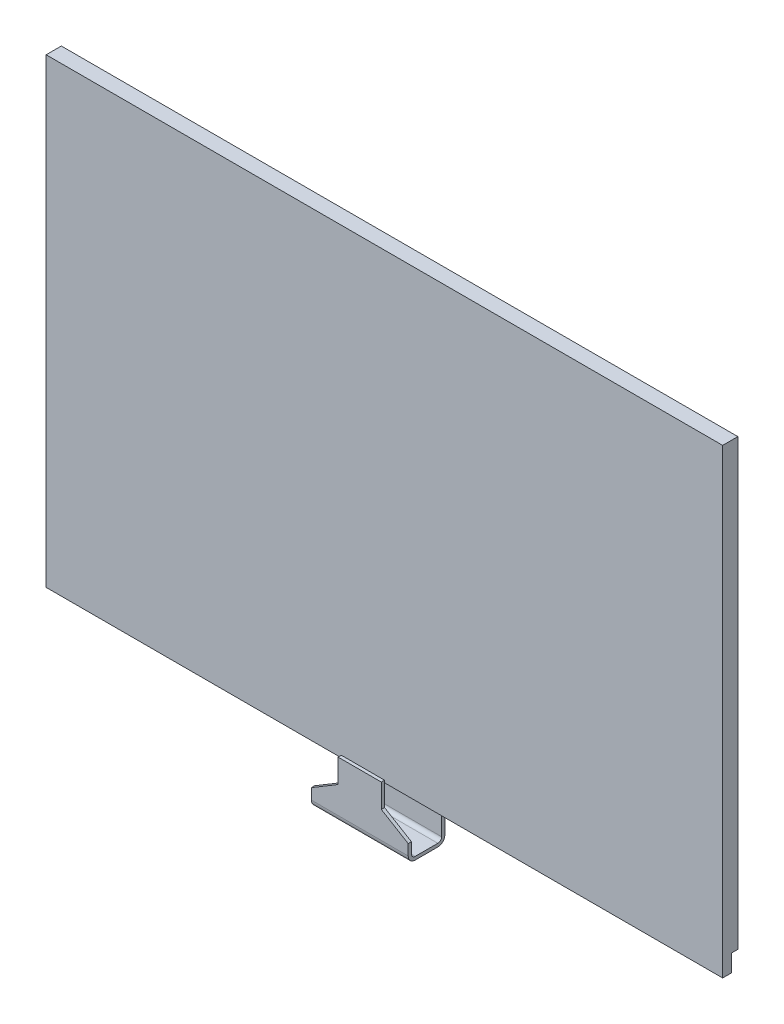
ISO-10303-21;
HEADER;
FILE_DESCRIPTION(('STEP AP214'),'2;1');
FILE_NAME('part.step','',(''),(''),'','','');
FILE_SCHEMA(('AUTOMOTIVE_DESIGN { 1 0 10303 214 1 1 1 1 }'));
ENDSEC;
DATA;
#1=APPLICATION_CONTEXT('core data for automotive mechanical design processes');
#2=APPLICATION_PROTOCOL_DEFINITION('international standard','automotive_design',2000,#1);
#3=PRODUCT_CONTEXT('',#1,'mechanical');
#4=PRODUCT('Part','Part','',(#3));
#5=PRODUCT_RELATED_PRODUCT_CATEGORY('part','',(#4));
#6=PRODUCT_DEFINITION_FORMATION('','',#4);
#7=PRODUCT_DEFINITION_CONTEXT('part definition',#1,'design');
#8=PRODUCT_DEFINITION('design','',#6,#7);
#9=PRODUCT_DEFINITION_SHAPE('','',#8);
#10=(LENGTH_UNIT() NAMED_UNIT(*) SI_UNIT(.MILLI.,.METRE.));
#11=(NAMED_UNIT(*) PLANE_ANGLE_UNIT() SI_UNIT($,.RADIAN.));
#12=(NAMED_UNIT(*) SI_UNIT($,.STERADIAN.) SOLID_ANGLE_UNIT());
#13=UNCERTAINTY_MEASURE_WITH_UNIT(LENGTH_MEASURE(1.E-05),#10,'distance_accuracy_value','');
#14=(GEOMETRIC_REPRESENTATION_CONTEXT(3) GLOBAL_UNCERTAINTY_ASSIGNED_CONTEXT((#13)) GLOBAL_UNIT_ASSIGNED_CONTEXT((#10,
#11,#12)) REPRESENTATION_CONTEXT('',''));
#15=CARTESIAN_POINT('',(0.,0.,0.));
#16=DIRECTION('',(0.,0.,1.));
#17=DIRECTION('',(1.,0.,0.));
#18=AXIS2_PLACEMENT_3D('',#15,#16,#17);
#19=CARTESIAN_POINT('',(31.4,21.41,0.));
#20=DIRECTION('',(0.,0.,1.));
#21=DIRECTION('',(1.,0.,0.));
#22=AXIS2_PLACEMENT_3D('',#19,#20,#21);
#23=PLANE('',#22);
#24=DIRECTION('',(1.,0.,0.));
#25=VECTOR('',#24,1.);
#26=CARTESIAN_POINT('',(31.4,1.6,0.));
#27=LINE('',#26,#25);
#28=CARTESIAN_POINT('',(0.,1.6,0.));
#29=VERTEX_POINT('',#28);
#30=CARTESIAN_POINT('',(62.8,1.6,0.));
#31=VERTEX_POINT('',#30);
#32=EDGE_CURVE('P0_E175',#29,#31,#27,.T.);
#33=ORIENTED_EDGE('',*,*,#32,.T.);
#34=DIRECTION('',(0.,-1.,0.));
#35=VECTOR('',#34,1.);
#36=CARTESIAN_POINT('',(62.8,42.82,0.));
#37=LINE('',#36,#35);
#38=CARTESIAN_POINT('',(62.8,0.,0.));
#39=VERTEX_POINT('',#38);
#40=EDGE_CURVE('P0_E196',#31,#39,#37,.T.);
#41=ORIENTED_EDGE('',*,*,#40,.T.);
#42=DIRECTION('',(-1.,0.,0.));
#43=VECTOR('',#42,1.);
#44=CARTESIAN_POINT('',(62.8,0.,0.));
#45=LINE('',#44,#43);
#46=CARTESIAN_POINT('',(0.,0.,0.));
#47=VERTEX_POINT('',#46);
#48=EDGE_CURVE('P0_E190',#39,#47,#45,.T.);
#49=ORIENTED_EDGE('',*,*,#48,.T.);
#50=DIRECTION('',(0.,1.,0.));
#51=VECTOR('',#50,1.);
#52=CARTESIAN_POINT('',(0.,0.,0.));
#53=LINE('',#52,#51);
#54=EDGE_CURVE('P0_E11',#47,#29,#53,.T.);
#55=ORIENTED_EDGE('',*,*,#54,.T.);
#56=EDGE_LOOP('',(#33,#41,#49,#55));
#57=FACE_BOUND('',#56,.T.);
#58=ADVANCED_FACE('P0_F17',(#57),#23,.F.);
#59=CARTESIAN_POINT('',(31.4,21.41,0.81));
#60=DIRECTION('',(0.,0.,1.));
#61=DIRECTION('',(1.,0.,0.));
#62=AXIS2_PLACEMENT_3D('',#59,#60,#61);
#63=PLANE('',#62);
#64=DIRECTION('',(1.,0.,0.));
#65=VECTOR('',#64,1.);
#66=CARTESIAN_POINT('',(0.,42.82,0.81));
#67=LINE('',#66,#65);
#68=CARTESIAN_POINT('',(0.,42.82,0.81));
#69=VERTEX_POINT('',#68);
#70=CARTESIAN_POINT('',(62.8,42.82,0.81));
#71=VERTEX_POINT('',#70);
#72=EDGE_CURVE('P0_E133',#69,#71,#67,.T.);
#73=ORIENTED_EDGE('',*,*,#72,.F.);
#74=DIRECTION('',(0.,1.,0.));
#75=VECTOR('',#74,1.);
#76=CARTESIAN_POINT('',(0.,0.,0.81));
#77=LINE('',#76,#75);
#78=CARTESIAN_POINT('',(0.,0.,0.81));
#79=VERTEX_POINT('',#78);
#80=EDGE_CURVE('P0_E27',#79,#69,#77,.T.);
#81=ORIENTED_EDGE('',*,*,#80,.F.);
#82=DIRECTION('',(-1.,0.,0.));
#83=VECTOR('',#82,1.);
#84=CARTESIAN_POINT('',(62.8,0.,0.81));
#85=LINE('',#84,#83);
#86=CARTESIAN_POINT('',(62.8,0.,0.81));
#87=VERTEX_POINT('',#86);
#88=EDGE_CURVE('P0_E200',#87,#79,#85,.T.);
#89=ORIENTED_EDGE('',*,*,#88,.F.);
#90=DIRECTION('',(0.,-1.,0.));
#91=VECTOR('',#90,1.);
#92=CARTESIAN_POINT('',(62.8,42.82,0.81));
#93=LINE('',#92,#91);
#94=EDGE_CURVE('P0_E172',#71,#87,#93,.T.);
#95=ORIENTED_EDGE('',*,*,#94,.F.);
#96=EDGE_LOOP('',(#73,#81,#89,#95));
#97=FACE_BOUND('',#96,.T.);
#98=ADVANCED_FACE('P0_F300',(#97),#63,.T.);
#99=CARTESIAN_POINT('',(0.,21.41,0.));
#100=DIRECTION('',(-1.,0.,0.));
#101=DIRECTION('',(0.,1.,0.));
#102=AXIS2_PLACEMENT_3D('',#99,#100,#101);
#103=PLANE('',#102);
#104=ORIENTED_EDGE('',*,*,#80,.T.);
#105=DIRECTION('',(0.,0.,1.));
#106=VECTOR('',#105,1.);
#107=CARTESIAN_POINT('',(0.,42.82,0.));
#108=LINE('',#107,#106);
#109=CARTESIAN_POINT('',(0.,42.82,-0.6));
#110=VERTEX_POINT('',#109);
#111=EDGE_CURVE('P0_E137',#110,#69,#108,.T.);
#112=ORIENTED_EDGE('',*,*,#111,.F.);
#113=DIRECTION('',(0.,-1.,0.));
#114=VECTOR('',#113,1.);
#115=CARTESIAN_POINT('',(0.,1.6,-0.6));
#116=LINE('',#115,#114);
#117=CARTESIAN_POINT('',(0.,1.6,-0.6));
#118=VERTEX_POINT('',#117);
#119=EDGE_CURVE('P0_E94',#110,#118,#116,.T.);
#120=ORIENTED_EDGE('',*,*,#119,.T.);
#121=DIRECTION('',(0.,0.,-1.));
#122=VECTOR('',#121,1.);
#123=CARTESIAN_POINT('',(0.,1.6,0.));
#124=LINE('',#123,#122);
#125=EDGE_CURVE('P0_E156',#29,#118,#124,.T.);
#126=ORIENTED_EDGE('',*,*,#125,.F.);
#127=ORIENTED_EDGE('',*,*,#54,.F.);
#128=DIRECTION('',(0.,0.,1.));
#129=VECTOR('',#128,1.);
#130=CARTESIAN_POINT('',(0.,0.,0.));
#131=LINE('',#130,#129);
#132=EDGE_CURVE('P0_E206',#47,#79,#131,.T.);
#133=ORIENTED_EDGE('',*,*,#132,.T.);
#134=EDGE_LOOP('',(#104,#112,#120,#126,#127,#133));
#135=FACE_BOUND('',#134,.T.);
#136=ADVANCED_FACE('P0_F277',(#135),#103,.T.);
#137=CARTESIAN_POINT('',(31.4,0.,0.));
#138=DIRECTION('',(0.,-1.,0.));
#139=DIRECTION('',(0.,0.,-1.));
#140=AXIS2_PLACEMENT_3D('',#137,#138,#139);
#141=PLANE('',#140);
#142=ORIENTED_EDGE('',*,*,#88,.T.);
#143=ORIENTED_EDGE('',*,*,#132,.F.);
#144=ORIENTED_EDGE('',*,*,#48,.F.);
#145=DIRECTION('',(0.,0.,1.));
#146=VECTOR('',#145,1.);
#147=CARTESIAN_POINT('',(62.8,0.,0.));
#148=LINE('',#147,#146);
#149=EDGE_CURVE('P0_E21',#39,#87,#148,.T.);
#150=ORIENTED_EDGE('',*,*,#149,.T.);
#151=EDGE_LOOP('',(#142,#143,#144,#150));
#152=FACE_BOUND('',#151,.T.);
#153=ADVANCED_FACE('P0_F272',(#152),#141,.T.);
#154=CARTESIAN_POINT('',(62.8,21.41,0.));
#155=DIRECTION('',(1.,0.,0.));
#156=DIRECTION('',(0.,1.,0.));
#157=AXIS2_PLACEMENT_3D('',#154,#155,#156);
#158=PLANE('',#157);
#159=ORIENTED_EDGE('',*,*,#94,.T.);
#160=ORIENTED_EDGE('',*,*,#149,.F.);
#161=ORIENTED_EDGE('',*,*,#40,.F.);
#162=DIRECTION('',(0.,0.,-1.));
#163=VECTOR('',#162,1.);
#164=CARTESIAN_POINT('',(62.8,1.6,0.));
#165=LINE('',#164,#163);
#166=CARTESIAN_POINT('',(62.8,1.6,-0.6));
#167=VERTEX_POINT('',#166);
#168=EDGE_CURVE('P0_E143',#31,#167,#165,.T.);
#169=ORIENTED_EDGE('',*,*,#168,.T.);
#170=DIRECTION('',(0.,1.,0.));
#171=VECTOR('',#170,1.);
#172=CARTESIAN_POINT('',(62.8,42.82,-0.6));
#173=LINE('',#172,#171);
#174=CARTESIAN_POINT('',(62.8,42.82,-0.6));
#175=VERTEX_POINT('',#174);
#176=EDGE_CURVE('P0_E140',#167,#175,#173,.T.);
#177=ORIENTED_EDGE('',*,*,#176,.T.);
#178=DIRECTION('',(0.,0.,1.));
#179=VECTOR('',#178,1.);
#180=CARTESIAN_POINT('',(62.8,42.82,0.));
#181=LINE('',#180,#179);
#182=EDGE_CURVE('P0_E127',#175,#71,#181,.T.);
#183=ORIENTED_EDGE('',*,*,#182,.T.);
#184=EDGE_LOOP('',(#159,#160,#161,#169,#177,#183));
#185=FACE_BOUND('',#184,.T.);
#186=ADVANCED_FACE('P0_F141',(#185),#158,.T.);
#187=CARTESIAN_POINT('',(31.4,42.82,0.));
#188=DIRECTION('',(0.,1.,0.));
#189=DIRECTION('',(1.,0.,0.));
#190=AXIS2_PLACEMENT_3D('',#187,#188,#189);
#191=PLANE('',#190);
#192=ORIENTED_EDGE('',*,*,#72,.T.);
#193=ORIENTED_EDGE('',*,*,#182,.F.);
#194=DIRECTION('',(-1.,0.,0.));
#195=VECTOR('',#194,1.);
#196=CARTESIAN_POINT('',(0.,42.82,-0.6));
#197=LINE('',#196,#195);
#198=EDGE_CURVE('P0_E132',#175,#110,#197,.T.);
#199=ORIENTED_EDGE('',*,*,#198,.T.);
#200=ORIENTED_EDGE('',*,*,#111,.T.);
#201=EDGE_LOOP('',(#192,#193,#199,#200));
#202=FACE_BOUND('',#201,.T.);
#203=ADVANCED_FACE('P0_F129',(#202),#191,.T.);
#204=CARTESIAN_POINT('',(31.4,22.21,-0.6));
#205=DIRECTION('',(0.,0.,1.));
#206=DIRECTION('',(1.,0.,0.));
#207=AXIS2_PLACEMENT_3D('',#204,#205,#206);
#208=PLANE('',#207);
#209=ORIENTED_EDGE('',*,*,#119,.F.);
#210=ORIENTED_EDGE('',*,*,#198,.F.);
#211=ORIENTED_EDGE('',*,*,#176,.F.);
#212=DIRECTION('',(1.,0.,0.));
#213=VECTOR('',#212,1.);
#214=CARTESIAN_POINT('',(62.8,1.6,-0.6));
#215=LINE('',#214,#213);
#216=EDGE_CURVE('P0_E169',#118,#167,#215,.T.);
#217=ORIENTED_EDGE('',*,*,#216,.F.);
#218=EDGE_LOOP('',(#209,#210,#211,#217));
#219=FACE_BOUND('',#218,.T.);
#220=DIRECTION('',(0.,-1.,0.));
#221=VECTOR('',#220,1.);
#222=CARTESIAN_POINT('',(0.4,22.26,-0.6));
#223=LINE('',#222,#221);
#224=CARTESIAN_POINT('',(0.4,42.52,-0.6));
#225=VERTEX_POINT('',#224);
#226=CARTESIAN_POINT('',(0.4,2.1,-0.6));
#227=VERTEX_POINT('',#226);
#228=EDGE_CURVE('P0_E163',#225,#227,#223,.T.);
#229=ORIENTED_EDGE('',*,*,#228,.T.);
#230=DIRECTION('',(1.,0.,0.));
#231=VECTOR('',#230,1.);
#232=CARTESIAN_POINT('',(31.4,2.1,-0.6));
#233=LINE('',#232,#231);
#234=CARTESIAN_POINT('',(62.4,2.1,-0.6));
#235=VERTEX_POINT('',#234);
#236=EDGE_CURVE('P0_E195',#227,#235,#233,.T.);
#237=ORIENTED_EDGE('',*,*,#236,.T.);
#238=DIRECTION('',(0.,1.,0.));
#239=VECTOR('',#238,1.);
#240=CARTESIAN_POINT('',(62.4,22.26,-0.6));
#241=LINE('',#240,#239);
#242=CARTESIAN_POINT('',(62.4,42.52,-0.6));
#243=VERTEX_POINT('',#242);
#244=EDGE_CURVE('P0_E182',#235,#243,#241,.T.);
#245=ORIENTED_EDGE('',*,*,#244,.T.);
#246=DIRECTION('',(-1.,0.,0.));
#247=VECTOR('',#246,1.);
#248=CARTESIAN_POINT('',(31.4,42.52,-0.6));
#249=LINE('',#248,#247);
#250=EDGE_CURVE('P0_E84',#243,#225,#249,.T.);
#251=ORIENTED_EDGE('',*,*,#250,.T.);
#252=EDGE_LOOP('',(#229,#237,#245,#251));
#253=FACE_BOUND('',#252,.T.);
#254=ADVANCED_FACE('P0_F149',(#219,#253),#208,.F.);
#255=CARTESIAN_POINT('',(31.4,1.6,0.));
#256=DIRECTION('',(0.,-1.,0.));
#257=DIRECTION('',(0.,0.,-1.));
#258=AXIS2_PLACEMENT_3D('',#255,#256,#257);
#259=PLANE('',#258);
#260=ORIENTED_EDGE('',*,*,#216,.T.);
#261=ORIENTED_EDGE('',*,*,#168,.F.);
#262=ORIENTED_EDGE('',*,*,#32,.F.);
#263=ORIENTED_EDGE('',*,*,#125,.T.);
#264=EDGE_LOOP('',(#260,#261,#262,#263));
#265=FACE_BOUND('',#264,.T.);
#266=ADVANCED_FACE('P0_F259',(#265),#259,.T.);
#267=CARTESIAN_POINT('',(31.4,22.31,-0.83));
#268=DIRECTION('',(0.,0.,1.));
#269=DIRECTION('',(0.,-1.,0.));
#270=AXIS2_PLACEMENT_3D('',#267,#268,#269);
#271=PLANE('',#270);
#272=DIRECTION('',(0.,-1.,0.));
#273=VECTOR('',#272,1.);
#274=CARTESIAN_POINT('',(0.4,2.1,-0.83));
#275=LINE('',#274,#273);
#276=CARTESIAN_POINT('',(0.4,42.52,-0.83));
#277=VERTEX_POINT('',#276);
#278=CARTESIAN_POINT('',(0.4,2.1,-0.83));
#279=VERTEX_POINT('',#278);
#280=EDGE_CURVE('P0_E164',#277,#279,#275,.T.);
#281=ORIENTED_EDGE('',*,*,#280,.F.);
#282=DIRECTION('',(-1.,0.,0.));
#283=VECTOR('',#282,1.);
#284=CARTESIAN_POINT('',(0.4,42.52,-0.83));
#285=LINE('',#284,#283);
#286=CARTESIAN_POINT('',(62.4,42.52,-0.83));
#287=VERTEX_POINT('',#286);
#288=EDGE_CURVE('P0_E181',#287,#277,#285,.T.);
#289=ORIENTED_EDGE('',*,*,#288,.F.);
#290=DIRECTION('',(0.,1.,0.));
#291=VECTOR('',#290,1.);
#292=CARTESIAN_POINT('',(62.4,42.52,-0.83));
#293=LINE('',#292,#291);
#294=CARTESIAN_POINT('',(62.4,2.1,-0.83));
#295=VERTEX_POINT('',#294);
#296=EDGE_CURVE('P0_E191',#295,#287,#293,.T.);
#297=ORIENTED_EDGE('',*,*,#296,.F.);
#298=DIRECTION('',(1.,0.,0.));
#299=VECTOR('',#298,1.);
#300=CARTESIAN_POINT('',(62.4,2.1,-0.83));
#301=LINE('',#300,#299);
#302=EDGE_CURVE('P0_E220',#279,#295,#301,.T.);
#303=ORIENTED_EDGE('',*,*,#302,.F.);
#304=EDGE_LOOP('',(#281,#289,#297,#303));
#305=FACE_BOUND('',#304,.T.);
#306=ADVANCED_FACE('P0_F19',(#305),#271,.F.);
#307=CARTESIAN_POINT('',(31.4,42.52,-0.6));
#308=DIRECTION('',(0.,1.,0.));
#309=DIRECTION('',(1.,0.,0.));
#310=AXIS2_PLACEMENT_3D('',#307,#308,#309);
#311=PLANE('',#310);
#312=ORIENTED_EDGE('',*,*,#288,.T.);
#313=DIRECTION('',(0.,0.,-1.));
#314=VECTOR('',#313,1.);
#315=CARTESIAN_POINT('',(0.4,42.52,-0.6));
#316=LINE('',#315,#314);
#317=EDGE_CURVE('P0_E168',#225,#277,#316,.T.);
#318=ORIENTED_EDGE('',*,*,#317,.F.);
#319=ORIENTED_EDGE('',*,*,#250,.F.);
#320=DIRECTION('',(0.,0.,-1.));
#321=VECTOR('',#320,1.);
#322=CARTESIAN_POINT('',(62.4,42.52,-0.6));
#323=LINE('',#322,#321);
#324=EDGE_CURVE('P0_E185',#243,#287,#323,.T.);
#325=ORIENTED_EDGE('',*,*,#324,.T.);
#326=EDGE_LOOP('',(#312,#318,#319,#325));
#327=FACE_BOUND('',#326,.T.);
#328=ADVANCED_FACE('P0_F258',(#327),#311,.T.);
#329=CARTESIAN_POINT('',(62.4,22.31,-0.6));
#330=DIRECTION('',(1.,0.,0.));
#331=DIRECTION('',(0.,1.,0.));
#332=AXIS2_PLACEMENT_3D('',#329,#330,#331);
#333=PLANE('',#332);
#334=ORIENTED_EDGE('',*,*,#296,.T.);
#335=ORIENTED_EDGE('',*,*,#324,.F.);
#336=ORIENTED_EDGE('',*,*,#244,.F.);
#337=DIRECTION('',(0.,0.,-1.));
#338=VECTOR('',#337,1.);
#339=CARTESIAN_POINT('',(62.4,2.1,-0.6));
#340=LINE('',#339,#338);
#341=EDGE_CURVE('P0_E223',#235,#295,#340,.T.);
#342=ORIENTED_EDGE('',*,*,#341,.T.);
#343=EDGE_LOOP('',(#334,#335,#336,#342));
#344=FACE_BOUND('',#343,.T.);
#345=ADVANCED_FACE('P0_F292',(#344),#333,.T.);
#346=CARTESIAN_POINT('',(31.4,2.1,-0.6));
#347=DIRECTION('',(0.,-1.,0.));
#348=DIRECTION('',(0.,0.,-1.));
#349=AXIS2_PLACEMENT_3D('',#346,#347,#348);
#350=PLANE('',#349);
#351=ORIENTED_EDGE('',*,*,#302,.T.);
#352=ORIENTED_EDGE('',*,*,#341,.F.);
#353=ORIENTED_EDGE('',*,*,#236,.F.);
#354=DIRECTION('',(0.,0.,-1.));
#355=VECTOR('',#354,1.);
#356=CARTESIAN_POINT('',(0.4,2.1,-0.6));
#357=LINE('',#356,#355);
#358=EDGE_CURVE('P0_E159',#227,#279,#357,.T.);
#359=ORIENTED_EDGE('',*,*,#358,.T.);
#360=EDGE_LOOP('',(#351,#352,#353,#359));
#361=FACE_BOUND('',#360,.T.);
#362=ADVANCED_FACE('P0_F246',(#361),#350,.T.);
#363=CARTESIAN_POINT('',(0.4,22.31,-0.6));
#364=DIRECTION('',(-1.,0.,0.));
#365=DIRECTION('',(0.,0.,1.));
#366=AXIS2_PLACEMENT_3D('',#363,#364,#365);
#367=PLANE('',#366);
#368=ORIENTED_EDGE('',*,*,#280,.T.);
#369=ORIENTED_EDGE('',*,*,#358,.F.);
#370=ORIENTED_EDGE('',*,*,#228,.F.);
#371=ORIENTED_EDGE('',*,*,#317,.T.);
#372=EDGE_LOOP('',(#368,#369,#370,#371));
#373=FACE_BOUND('',#372,.T.);
#374=ADVANCED_FACE('P0_F240',(#373),#367,.T.);
#375=CLOSED_SHELL('',(#58,#98,#136,#153,#186,#203,#254,#266,#306,#328,#345,#362,#374));
#376=MANIFOLD_SOLID_BREP('P0_B1',#375);
#377=CARTESIAN_POINT('',(31.4,23.18,-0.835));
#378=DIRECTION('',(0.,0.,1.));
#379=DIRECTION('',(1.,0.,0.));
#380=AXIS2_PLACEMENT_3D('',#377,#378,#379);
#381=PLANE('',#380);
#382=DIRECTION('',(0.,1.,0.));
#383=VECTOR('',#382,1.);
#384=CARTESIAN_POINT('',(2.,5.54,-0.835));
#385=LINE('',#384,#383);
#386=CARTESIAN_POINT('',(2.,5.54,-0.835));
#387=VERTEX_POINT('',#386);
#388=CARTESIAN_POINT('',(2.,40.82,-0.835));
#389=VERTEX_POINT('',#388);
#390=EDGE_CURVE('P1_E11',#387,#389,#385,.T.);
#391=ORIENTED_EDGE('',*,*,#390,.T.);
#392=DIRECTION('',(1.,0.,0.));
#393=VECTOR('',#392,1.);
#394=CARTESIAN_POINT('',(2.,40.82,-0.835));
#395=LINE('',#394,#393);
#396=CARTESIAN_POINT('',(60.8,40.82,-0.835));
#397=VERTEX_POINT('',#396);
#398=EDGE_CURVE('P1_E80',#389,#397,#395,.T.);
#399=ORIENTED_EDGE('',*,*,#398,.T.);
#400=DIRECTION('',(0.,-1.,0.));
#401=VECTOR('',#400,1.);
#402=CARTESIAN_POINT('',(60.8,40.82,-0.835));
#403=LINE('',#402,#401);
#404=CARTESIAN_POINT('',(60.8,5.54,-0.835));
#405=VERTEX_POINT('',#404);
#406=EDGE_CURVE('P1_E107',#397,#405,#403,.T.);
#407=ORIENTED_EDGE('',*,*,#406,.T.);
#408=DIRECTION('',(-1.,0.,0.));
#409=VECTOR('',#408,1.);
#410=CARTESIAN_POINT('',(60.8,5.54,-0.835));
#411=LINE('',#410,#409);
#412=EDGE_CURVE('P1_E73',#405,#387,#411,.T.);
#413=ORIENTED_EDGE('',*,*,#412,.T.);
#414=EDGE_LOOP('',(#391,#399,#407,#413));
#415=FACE_BOUND('',#414,.T.);
#416=ADVANCED_FACE('P1_F17',(#415),#381,.F.);
#417=CARTESIAN_POINT('',(31.4,23.18,-0.83));
#418=DIRECTION('',(0.,0.,1.));
#419=DIRECTION('',(1.,0.,0.));
#420=AXIS2_PLACEMENT_3D('',#417,#418,#419);
#421=PLANE('',#420);
#422=DIRECTION('',(1.,0.,0.));
#423=VECTOR('',#422,1.);
#424=CARTESIAN_POINT('',(2.,40.82,-0.83));
#425=LINE('',#424,#423);
#426=CARTESIAN_POINT('',(2.,40.82,-0.83));
#427=VERTEX_POINT('',#426);
#428=CARTESIAN_POINT('',(60.8,40.82,-0.83));
#429=VERTEX_POINT('',#428);
#430=EDGE_CURVE('P1_E20',#427,#429,#425,.T.);
#431=ORIENTED_EDGE('',*,*,#430,.F.);
#432=DIRECTION('',(0.,1.,0.));
#433=VECTOR('',#432,1.);
#434=CARTESIAN_POINT('',(2.,5.54,-0.83));
#435=LINE('',#434,#433);
#436=CARTESIAN_POINT('',(2.,5.54,-0.83));
#437=VERTEX_POINT('',#436);
#438=EDGE_CURVE('P1_E27',#437,#427,#435,.T.);
#439=ORIENTED_EDGE('',*,*,#438,.F.);
#440=DIRECTION('',(-1.,0.,0.));
#441=VECTOR('',#440,1.);
#442=CARTESIAN_POINT('',(60.8,5.54,-0.83));
#443=LINE('',#442,#441);
#444=CARTESIAN_POINT('',(60.8,5.54,-0.83));
#445=VERTEX_POINT('',#444);
#446=EDGE_CURVE('P1_E105',#445,#437,#443,.T.);
#447=ORIENTED_EDGE('',*,*,#446,.F.);
#448=DIRECTION('',(0.,-1.,0.));
#449=VECTOR('',#448,1.);
#450=CARTESIAN_POINT('',(60.8,40.82,-0.83));
#451=LINE('',#450,#449);
#452=EDGE_CURVE('P1_E82',#429,#445,#451,.T.);
#453=ORIENTED_EDGE('',*,*,#452,.F.);
#454=EDGE_LOOP('',(#431,#439,#447,#453));
#455=FACE_BOUND('',#454,.T.);
#456=ADVANCED_FACE('P1_F84',(#455),#421,.T.);
#457=CARTESIAN_POINT('',(2.,23.18,-0.835));
#458=DIRECTION('',(-1.,0.,0.));
#459=DIRECTION('',(0.,1.,0.));
#460=AXIS2_PLACEMENT_3D('',#457,#458,#459);
#461=PLANE('',#460);
#462=ORIENTED_EDGE('',*,*,#438,.T.);
#463=DIRECTION('',(0.,0.,1.));
#464=VECTOR('',#463,1.);
#465=CARTESIAN_POINT('',(2.,40.82,-0.835));
#466=LINE('',#465,#464);
#467=EDGE_CURVE('P1_E65',#389,#427,#466,.T.);
#468=ORIENTED_EDGE('',*,*,#467,.F.);
#469=ORIENTED_EDGE('',*,*,#390,.F.);
#470=DIRECTION('',(0.,0.,1.));
#471=VECTOR('',#470,1.);
#472=CARTESIAN_POINT('',(2.,5.54,-0.835));
#473=LINE('',#472,#471);
#474=EDGE_CURVE('P1_E68',#387,#437,#473,.T.);
#475=ORIENTED_EDGE('',*,*,#474,.T.);
#476=EDGE_LOOP('',(#462,#468,#469,#475));
#477=FACE_BOUND('',#476,.T.);
#478=ADVANCED_FACE('P1_F64',(#477),#461,.T.);
#479=CARTESIAN_POINT('',(31.4,5.54,-0.835));
#480=DIRECTION('',(0.,-1.,0.));
#481=DIRECTION('',(0.,0.,-1.));
#482=AXIS2_PLACEMENT_3D('',#479,#480,#481);
#483=PLANE('',#482);
#484=ORIENTED_EDGE('',*,*,#446,.T.);
#485=ORIENTED_EDGE('',*,*,#474,.F.);
#486=ORIENTED_EDGE('',*,*,#412,.F.);
#487=DIRECTION('',(0.,0.,1.));
#488=VECTOR('',#487,1.);
#489=CARTESIAN_POINT('',(60.8,5.54,-0.835));
#490=LINE('',#489,#488);
#491=EDGE_CURVE('P1_E103',#405,#445,#490,.T.);
#492=ORIENTED_EDGE('',*,*,#491,.T.);
#493=EDGE_LOOP('',(#484,#485,#486,#492));
#494=FACE_BOUND('',#493,.T.);
#495=ADVANCED_FACE('P1_F124',(#494),#483,.T.);
#496=CARTESIAN_POINT('',(60.8,23.18,-0.835));
#497=DIRECTION('',(1.,0.,0.));
#498=DIRECTION('',(0.,1.,0.));
#499=AXIS2_PLACEMENT_3D('',#496,#497,#498);
#500=PLANE('',#499);
#501=ORIENTED_EDGE('',*,*,#452,.T.);
#502=ORIENTED_EDGE('',*,*,#491,.F.);
#503=ORIENTED_EDGE('',*,*,#406,.F.);
#504=DIRECTION('',(0.,0.,1.));
#505=VECTOR('',#504,1.);
#506=CARTESIAN_POINT('',(60.8,40.82,-0.835));
#507=LINE('',#506,#505);
#508=EDGE_CURVE('P1_E88',#397,#429,#507,.T.);
#509=ORIENTED_EDGE('',*,*,#508,.T.);
#510=EDGE_LOOP('',(#501,#502,#503,#509));
#511=FACE_BOUND('',#510,.T.);
#512=ADVANCED_FACE('P1_F125',(#511),#500,.T.);
#513=CARTESIAN_POINT('',(31.4,40.82,-0.835));
#514=DIRECTION('',(0.,1.,0.));
#515=DIRECTION('',(1.,0.,0.));
#516=AXIS2_PLACEMENT_3D('',#513,#514,#515);
#517=PLANE('',#516);
#518=ORIENTED_EDGE('',*,*,#430,.T.);
#519=ORIENTED_EDGE('',*,*,#508,.F.);
#520=ORIENTED_EDGE('',*,*,#398,.F.);
#521=ORIENTED_EDGE('',*,*,#467,.T.);
#522=EDGE_LOOP('',(#518,#519,#520,#521));
#523=FACE_BOUND('',#522,.T.);
#524=ADVANCED_FACE('P1_F77',(#523),#517,.T.);
#525=CLOSED_SHELL('',(#416,#456,#478,#495,#512,#524));
#526=MANIFOLD_SOLID_BREP('P1_B1',#525);
#527=CARTESIAN_POINT('',(26.9,-2.5,0.35));
#528=DIRECTION('',(1.,0.,0.));
#529=DIRECTION('',(0.,-1.,0.));
#530=AXIS2_PLACEMENT_3D('',#527,#528,#529);
#531=CYLINDRICAL_SURFACE('',#530,0.35);
#532=CARTESIAN_POINT('',(35.9,-2.5,0.35));
#533=DIRECTION('',(1.,0.,0.));
#534=DIRECTION('',(0.,-1.,0.));
#535=AXIS2_PLACEMENT_3D('',#532,#533,#534);
#536=CIRCLE('',#535,0.35);
#537=CARTESIAN_POINT('',(35.9,-2.85,0.35));
#538=VERTEX_POINT('',#537);
#539=CARTESIAN_POINT('',(35.9,-2.5,0.));
#540=VERTEX_POINT('',#539);
#541=EDGE_CURVE('P2_E220',#538,#540,#536,.T.);
#542=ORIENTED_EDGE('',*,*,#541,.T.);
#543=DIRECTION('',(1.,0.,0.));
#544=VECTOR('',#543,1.);
#545=CARTESIAN_POINT('',(26.9,-2.5,0.));
#546=LINE('',#545,#544);
#547=CARTESIAN_POINT('',(26.9,-2.5,0.));
#548=VERTEX_POINT('',#547);
#549=EDGE_CURVE('P2_E236',#548,#540,#546,.T.);
#550=ORIENTED_EDGE('',*,*,#549,.F.);
#551=CARTESIAN_POINT('',(26.9,-2.5,0.35));
#552=DIRECTION('',(1.,0.,0.));
#553=DIRECTION('',(0.,-1.,0.));
#554=AXIS2_PLACEMENT_3D('',#551,#552,#553);
#555=CIRCLE('',#554,0.35);
#556=CARTESIAN_POINT('',(26.9,-2.85,0.35));
#557=VERTEX_POINT('',#556);
#558=EDGE_CURVE('P2_E274',#557,#548,#555,.T.);
#559=ORIENTED_EDGE('',*,*,#558,.F.);
#560=DIRECTION('',(1.,0.,0.));
#561=VECTOR('',#560,1.);
#562=CARTESIAN_POINT('',(26.9,-2.85,0.35));
#563=LINE('',#562,#561);
#564=EDGE_CURVE('P2_E10',#557,#538,#563,.T.);
#565=ORIENTED_EDGE('',*,*,#564,.T.);
#566=EDGE_LOOP('',(#542,#550,#559,#565));
#567=FACE_BOUND('',#566,.T.);
#568=ADVANCED_FACE('P2_F16',(#567),#531,.F.);
#569=CARTESIAN_POINT('',(26.9,-2.85,1.4));
#570=DIRECTION('',(0.,1.,0.));
#571=DIRECTION('',(1.,0.,0.));
#572=AXIS2_PLACEMENT_3D('',#569,#570,#571);
#573=PLANE('',#572);
#574=DIRECTION('',(0.,0.,-1.));
#575=VECTOR('',#574,1.);
#576=CARTESIAN_POINT('',(35.9,-2.85,2.45));
#577=LINE('',#576,#575);
#578=CARTESIAN_POINT('',(35.9,-2.85,2.45));
#579=VERTEX_POINT('',#578);
#580=EDGE_CURVE('P2_E215',#579,#538,#577,.T.);
#581=ORIENTED_EDGE('',*,*,#580,.T.);
#582=ORIENTED_EDGE('',*,*,#564,.F.);
#583=DIRECTION('',(0.,0.,-1.));
#584=VECTOR('',#583,1.);
#585=CARTESIAN_POINT('',(26.9,-2.85,2.45));
#586=LINE('',#585,#584);
#587=CARTESIAN_POINT('',(26.9,-2.85,2.45));
#588=VERTEX_POINT('',#587);
#589=EDGE_CURVE('P2_E278',#588,#557,#586,.T.);
#590=ORIENTED_EDGE('',*,*,#589,.F.);
#591=DIRECTION('',(1.,0.,0.));
#592=VECTOR('',#591,1.);
#593=CARTESIAN_POINT('',(26.9,-2.85,2.45));
#594=LINE('',#593,#592);
#595=EDGE_CURVE('P2_E27',#588,#579,#594,.T.);
#596=ORIENTED_EDGE('',*,*,#595,.T.);
#597=EDGE_LOOP('',(#581,#582,#590,#596));
#598=FACE_BOUND('',#597,.T.);
#599=ADVANCED_FACE('P2_F418',(#598),#573,.T.);
#600=CARTESIAN_POINT('',(26.9,-2.5,2.45));
#601=DIRECTION('',(1.,0.,0.));
#602=DIRECTION('',(0.,-1.,0.));
#603=AXIS2_PLACEMENT_3D('',#600,#601,#602);
#604=CYLINDRICAL_SURFACE('',#603,0.35);
#605=CARTESIAN_POINT('',(35.9,-2.5,2.45));
#606=DIRECTION('',(1.,0.,0.));
#607=DIRECTION('',(0.,-1.,0.));
#608=AXIS2_PLACEMENT_3D('',#605,#606,#607);
#609=CIRCLE('',#608,0.35);
#610=CARTESIAN_POINT('',(35.9,-2.5,2.8));
#611=VERTEX_POINT('',#610);
#612=EDGE_CURVE('P2_E219',#611,#579,#609,.T.);
#613=ORIENTED_EDGE('',*,*,#612,.T.);
#614=ORIENTED_EDGE('',*,*,#595,.F.);
#615=CARTESIAN_POINT('',(26.9,-2.5,2.45));
#616=DIRECTION('',(1.,0.,0.));
#617=DIRECTION('',(0.,-1.,0.));
#618=AXIS2_PLACEMENT_3D('',#615,#616,#617);
#619=CIRCLE('',#618,0.35);
#620=CARTESIAN_POINT('',(26.9,-2.5,2.8));
#621=VERTEX_POINT('',#620);
#622=EDGE_CURVE('P2_E209',#621,#588,#619,.T.);
#623=ORIENTED_EDGE('',*,*,#622,.F.);
#624=DIRECTION('',(1.,0.,0.));
#625=VECTOR('',#624,1.);
#626=CARTESIAN_POINT('',(26.9,-2.5,2.8));
#627=LINE('',#626,#625);
#628=EDGE_CURVE('P2_E185',#621,#611,#627,.T.);
#629=ORIENTED_EDGE('',*,*,#628,.T.);
#630=EDGE_LOOP('',(#613,#614,#623,#629));
#631=FACE_BOUND('',#630,.T.);
#632=ADVANCED_FACE('P2_F420',(#631),#604,.F.);
#633=CARTESIAN_POINT('',(26.9,2.2,2.95));
#634=DIRECTION('',(0.,1.,0.));
#635=DIRECTION('',(1.,0.,0.));
#636=AXIS2_PLACEMENT_3D('',#633,#634,#635);
#637=PLANE('',#636);
#638=DIRECTION('',(0.,0.,-1.));
#639=VECTOR('',#638,1.);
#640=CARTESIAN_POINT('',(33.4,2.2,2.4));
#641=LINE('',#640,#639);
#642=CARTESIAN_POINT('',(33.4,2.2,3.1));
#643=VERTEX_POINT('',#642);
#644=CARTESIAN_POINT('',(33.4,2.2,2.8));
#645=VERTEX_POINT('',#644);
#646=EDGE_CURVE('P2_E205',#643,#645,#641,.T.);
#647=ORIENTED_EDGE('',*,*,#646,.T.);
#648=DIRECTION('',(1.,0.,0.));
#649=VECTOR('',#648,1.);
#650=CARTESIAN_POINT('',(26.9,2.2,2.8));
#651=LINE('',#650,#649);
#652=CARTESIAN_POINT('',(29.4,2.2,2.8));
#653=VERTEX_POINT('',#652);
#654=EDGE_CURVE('P2_E188',#653,#645,#651,.T.);
#655=ORIENTED_EDGE('',*,*,#654,.F.);
#656=DIRECTION('',(0.,0.,1.));
#657=VECTOR('',#656,1.);
#658=CARTESIAN_POINT('',(29.4,2.2,2.4));
#659=LINE('',#658,#657);
#660=CARTESIAN_POINT('',(29.4,2.2,3.1));
#661=VERTEX_POINT('',#660);
#662=EDGE_CURVE('P2_E281',#653,#661,#659,.T.);
#663=ORIENTED_EDGE('',*,*,#662,.T.);
#664=DIRECTION('',(1.,0.,0.));
#665=VECTOR('',#664,1.);
#666=CARTESIAN_POINT('',(26.9,2.2,3.1));
#667=LINE('',#666,#665);
#668=EDGE_CURVE('P2_E284',#661,#643,#667,.T.);
#669=ORIENTED_EDGE('',*,*,#668,.T.);
#670=EDGE_LOOP('',(#647,#655,#663,#669));
#671=FACE_BOUND('',#670,.T.);
#672=ADVANCED_FACE('P2_F432',(#671),#637,.T.);
#673=CARTESIAN_POINT('',(26.9,-0.15,3.1));
#674=DIRECTION('',(0.,0.,1.));
#675=DIRECTION('',(0.,1.,0.));
#676=AXIS2_PLACEMENT_3D('',#673,#674,#675);
#677=PLANE('',#676);
#678=DIRECTION('',(0.,1.,0.));
#679=VECTOR('',#678,1.);
#680=CARTESIAN_POINT('',(33.4,0.675,3.1));
#681=LINE('',#680,#679);
#682=CARTESIAN_POINT('',(33.4,0.,3.1));
#683=VERTEX_POINT('',#682);
#684=EDGE_CURVE('P2_E86',#683,#643,#681,.T.);
#685=ORIENTED_EDGE('',*,*,#684,.T.);
#686=ORIENTED_EDGE('',*,*,#668,.F.);
#687=DIRECTION('',(0.,-1.,0.));
#688=VECTOR('',#687,1.);
#689=CARTESIAN_POINT('',(29.4,0.675,3.1));
#690=LINE('',#689,#688);
#691=CARTESIAN_POINT('',(29.4,0.,3.1));
#692=VERTEX_POINT('',#691);
#693=EDGE_CURVE('P2_E142',#661,#692,#690,.T.);
#694=ORIENTED_EDGE('',*,*,#693,.T.);
#695=DIRECTION('',(-0.857492925712534,-0.514495755427543,0.));
#696=VECTOR('',#695,1.);
#697=CARTESIAN_POINT('',(27.8227941176471,-0.94632352941179,3.1));
#698=LINE('',#697,#696);
#699=CARTESIAN_POINT('',(26.9000000000001,-1.50000000000003,3.1));
#700=VERTEX_POINT('',#699);
#701=EDGE_CURVE('P2_E195',#692,#700,#698,.T.);
#702=ORIENTED_EDGE('',*,*,#701,.T.);
#703=DIRECTION('',(0.,1.,0.));
#704=VECTOR('',#703,1.);
#705=CARTESIAN_POINT('',(26.9,-2.5,3.1));
#706=LINE('',#705,#704);
#707=CARTESIAN_POINT('',(26.9,-2.5,3.1));
#708=VERTEX_POINT('',#707);
#709=EDGE_CURVE('P2_E153',#708,#700,#706,.T.);
#710=ORIENTED_EDGE('',*,*,#709,.F.);
#711=DIRECTION('',(1.,0.,0.));
#712=VECTOR('',#711,1.);
#713=CARTESIAN_POINT('',(26.9,-2.5,3.1));
#714=LINE('',#713,#712);
#715=CARTESIAN_POINT('',(35.9,-2.5,3.1));
#716=VERTEX_POINT('',#715);
#717=EDGE_CURVE('P2_E41',#708,#716,#714,.T.);
#718=ORIENTED_EDGE('',*,*,#717,.T.);
#719=DIRECTION('',(0.,1.,0.));
#720=VECTOR('',#719,1.);
#721=CARTESIAN_POINT('',(35.9,-2.5,3.1));
#722=LINE('',#721,#720);
#723=CARTESIAN_POINT('',(35.8999999999999,-1.50000000000003,3.1));
#724=VERTEX_POINT('',#723);
#725=EDGE_CURVE('P2_E213',#716,#724,#722,.T.);
#726=ORIENTED_EDGE('',*,*,#725,.T.);
#727=DIRECTION('',(-0.857492925712534,0.514495755427543,0.));
#728=VECTOR('',#727,1.);
#729=CARTESIAN_POINT('',(31.6683823529412,1.03897058823531,3.1));
#730=LINE('',#729,#728);
#731=EDGE_CURVE('P2_E264',#724,#683,#730,.T.);
#732=ORIENTED_EDGE('',*,*,#731,.T.);
#733=EDGE_LOOP('',(#685,#686,#694,#702,#710,#718,#726,#732));
#734=FACE_BOUND('',#733,.T.);
#735=ADVANCED_FACE('P2_F374',(#734),#677,.T.);
#736=CARTESIAN_POINT('',(26.9,-2.5,2.45));
#737=DIRECTION('',(1.,0.,0.));
#738=DIRECTION('',(0.,-1.,0.));
#739=AXIS2_PLACEMENT_3D('',#736,#737,#738);
#740=CYLINDRICAL_SURFACE('',#739,0.65);
#741=CARTESIAN_POINT('',(35.9,-2.5,2.45));
#742=DIRECTION('',(-1.,0.,0.));
#743=DIRECTION('',(0.,-1.,0.));
#744=AXIS2_PLACEMENT_3D('',#741,#742,#743);
#745=CIRCLE('',#744,0.65);
#746=CARTESIAN_POINT('',(35.9,-3.15,2.45));
#747=VERTEX_POINT('',#746);
#748=EDGE_CURVE('P2_E245',#747,#716,#745,.T.);
#749=ORIENTED_EDGE('',*,*,#748,.T.);
#750=ORIENTED_EDGE('',*,*,#717,.F.);
#751=CARTESIAN_POINT('',(26.9,-2.5,2.45));
#752=DIRECTION('',(1.,0.,0.));
#753=DIRECTION('',(0.,-1.,0.));
#754=AXIS2_PLACEMENT_3D('',#751,#752,#753);
#755=CIRCLE('',#754,0.65);
#756=CARTESIAN_POINT('',(26.9,-3.15,2.45));
#757=VERTEX_POINT('',#756);
#758=EDGE_CURVE('P2_E235',#708,#757,#755,.T.);
#759=ORIENTED_EDGE('',*,*,#758,.T.);
#760=DIRECTION('',(1.,0.,0.));
#761=VECTOR('',#760,1.);
#762=CARTESIAN_POINT('',(26.9,-3.15,2.45));
#763=LINE('',#762,#761);
#764=EDGE_CURVE('P2_E285',#757,#747,#763,.T.);
#765=ORIENTED_EDGE('',*,*,#764,.T.);
#766=EDGE_LOOP('',(#749,#750,#759,#765));
#767=FACE_BOUND('',#766,.T.);
#768=ADVANCED_FACE('P2_F18',(#767),#740,.T.);
#769=CARTESIAN_POINT('',(26.9,-3.15,1.4));
#770=DIRECTION('',(0.,-1.,0.));
#771=DIRECTION('',(0.,0.,1.));
#772=AXIS2_PLACEMENT_3D('',#769,#770,#771);
#773=PLANE('',#772);
#774=DIRECTION('',(0.,0.,1.));
#775=VECTOR('',#774,1.);
#776=CARTESIAN_POINT('',(35.9,-3.15,0.35));
#777=LINE('',#776,#775);
#778=CARTESIAN_POINT('',(35.9,-3.15,0.35));
#779=VERTEX_POINT('',#778);
#780=EDGE_CURVE('P2_E240',#779,#747,#777,.T.);
#781=ORIENTED_EDGE('',*,*,#780,.T.);
#782=ORIENTED_EDGE('',*,*,#764,.F.);
#783=DIRECTION('',(0.,0.,1.));
#784=VECTOR('',#783,1.);
#785=CARTESIAN_POINT('',(26.9,-3.15,0.35));
#786=LINE('',#785,#784);
#787=CARTESIAN_POINT('',(26.9,-3.15,0.35));
#788=VERTEX_POINT('',#787);
#789=EDGE_CURVE('P2_E339',#788,#757,#786,.T.);
#790=ORIENTED_EDGE('',*,*,#789,.F.);
#791=DIRECTION('',(1.,0.,0.));
#792=VECTOR('',#791,1.);
#793=CARTESIAN_POINT('',(26.9,-3.15,0.35));
#794=LINE('',#793,#792);
#795=EDGE_CURVE('P2_E295',#788,#779,#794,.T.);
#796=ORIENTED_EDGE('',*,*,#795,.T.);
#797=EDGE_LOOP('',(#781,#782,#790,#796));
#798=FACE_BOUND('',#797,.T.);
#799=ADVANCED_FACE('P2_F370',(#798),#773,.T.);
#800=CARTESIAN_POINT('',(26.9,-2.5,0.35));
#801=DIRECTION('',(1.,0.,0.));
#802=DIRECTION('',(0.,-1.,0.));
#803=AXIS2_PLACEMENT_3D('',#800,#801,#802);
#804=CYLINDRICAL_SURFACE('',#803,0.65);
#805=CARTESIAN_POINT('',(35.9,-2.5,0.35));
#806=DIRECTION('',(-1.,0.,0.));
#807=DIRECTION('',(0.,-1.,0.));
#808=AXIS2_PLACEMENT_3D('',#805,#806,#807);
#809=CIRCLE('',#808,0.65);
#810=CARTESIAN_POINT('',(35.9,-2.5,-0.3));
#811=VERTEX_POINT('',#810);
#812=EDGE_CURVE('P2_E244',#811,#779,#809,.T.);
#813=ORIENTED_EDGE('',*,*,#812,.T.);
#814=ORIENTED_EDGE('',*,*,#795,.F.);
#815=CARTESIAN_POINT('',(26.9,-2.5,0.35));
#816=DIRECTION('',(1.,0.,0.));
#817=DIRECTION('',(0.,-1.,0.));
#818=AXIS2_PLACEMENT_3D('',#815,#816,#817);
#819=CIRCLE('',#818,0.65);
#820=CARTESIAN_POINT('',(26.9,-2.5,-0.3));
#821=VERTEX_POINT('',#820);
#822=EDGE_CURVE('P2_E335',#788,#821,#819,.T.);
#823=ORIENTED_EDGE('',*,*,#822,.T.);
#824=DIRECTION('',(1.,0.,0.));
#825=VECTOR('',#824,1.);
#826=CARTESIAN_POINT('',(26.9,-2.5,-0.3));
#827=LINE('',#826,#825);
#828=EDGE_CURVE('P2_E292',#821,#811,#827,.T.);
#829=ORIENTED_EDGE('',*,*,#828,.T.);
#830=EDGE_LOOP('',(#813,#814,#823,#829));
#831=FACE_BOUND('',#830,.T.);
#832=ADVANCED_FACE('P2_F378',(#831),#804,.T.);
#833=CARTESIAN_POINT('',(26.9,-0.45,-0.3));
#834=DIRECTION('',(0.,0.,-1.));
#835=DIRECTION('',(0.,-1.,0.));
#836=AXIS2_PLACEMENT_3D('',#833,#834,#835);
#837=PLANE('',#836);
#838=DIRECTION('',(0.,-1.,0.));
#839=VECTOR('',#838,1.);
#840=CARTESIAN_POINT('',(35.9,1.6,-0.3));
#841=LINE('',#840,#839);
#842=CARTESIAN_POINT('',(35.9,1.6,-0.3));
#843=VERTEX_POINT('',#842);
#844=EDGE_CURVE('P2_E253',#843,#811,#841,.T.);
#845=ORIENTED_EDGE('',*,*,#844,.T.);
#846=ORIENTED_EDGE('',*,*,#828,.F.);
#847=DIRECTION('',(0.,-1.,0.));
#848=VECTOR('',#847,1.);
#849=CARTESIAN_POINT('',(26.9,1.6,-0.3));
#850=LINE('',#849,#848);
#851=CARTESIAN_POINT('',(26.9,1.6,-0.3));
#852=VERTEX_POINT('',#851);
#853=EDGE_CURVE('P2_E230',#852,#821,#850,.T.);
#854=ORIENTED_EDGE('',*,*,#853,.F.);
#855=DIRECTION('',(1.,0.,0.));
#856=VECTOR('',#855,1.);
#857=CARTESIAN_POINT('',(26.9,1.6,-0.3));
#858=LINE('',#857,#856);
#859=EDGE_CURVE('P2_E238',#852,#843,#858,.T.);
#860=ORIENTED_EDGE('',*,*,#859,.T.);
#861=EDGE_LOOP('',(#845,#846,#854,#860));
#862=FACE_BOUND('',#861,.T.);
#863=ADVANCED_FACE('P2_F379',(#862),#837,.T.);
#864=CARTESIAN_POINT('',(26.9,1.6,-0.15));
#865=DIRECTION('',(0.,1.,0.));
#866=DIRECTION('',(1.,0.,0.));
#867=AXIS2_PLACEMENT_3D('',#864,#865,#866);
#868=PLANE('',#867);
#869=DIRECTION('',(0.,0.,-1.));
#870=VECTOR('',#869,1.);
#871=CARTESIAN_POINT('',(35.9,1.6,0.));
#872=LINE('',#871,#870);
#873=CARTESIAN_POINT('',(35.9,1.6,0.));
#874=VERTEX_POINT('',#873);
#875=EDGE_CURVE('P2_E248',#874,#843,#872,.T.);
#876=ORIENTED_EDGE('',*,*,#875,.T.);
#877=ORIENTED_EDGE('',*,*,#859,.F.);
#878=DIRECTION('',(0.,0.,-1.));
#879=VECTOR('',#878,1.);
#880=CARTESIAN_POINT('',(26.9,1.6,0.));
#881=LINE('',#880,#879);
#882=CARTESIAN_POINT('',(26.9,1.6,0.));
#883=VERTEX_POINT('',#882);
#884=EDGE_CURVE('P2_E226',#883,#852,#881,.T.);
#885=ORIENTED_EDGE('',*,*,#884,.F.);
#886=DIRECTION('',(1.,0.,0.));
#887=VECTOR('',#886,1.);
#888=CARTESIAN_POINT('',(26.9,1.6,0.));
#889=LINE('',#888,#887);
#890=EDGE_CURVE('P2_E234',#883,#874,#889,.T.);
#891=ORIENTED_EDGE('',*,*,#890,.T.);
#892=EDGE_LOOP('',(#876,#877,#885,#891));
#893=FACE_BOUND('',#892,.T.);
#894=ADVANCED_FACE('P2_F304',(#893),#868,.T.);
#895=CARTESIAN_POINT('',(26.9,-0.45,0.));
#896=DIRECTION('',(0.,0.,1.));
#897=DIRECTION('',(-1.,0.,0.));
#898=AXIS2_PLACEMENT_3D('',#895,#896,#897);
#899=PLANE('',#898);
#900=DIRECTION('',(0.,1.,0.));
#901=VECTOR('',#900,1.);
#902=CARTESIAN_POINT('',(35.9,-2.5,0.));
#903=LINE('',#902,#901);
#904=EDGE_CURVE('P2_E252',#540,#874,#903,.T.);
#905=ORIENTED_EDGE('',*,*,#904,.T.);
#906=ORIENTED_EDGE('',*,*,#890,.F.);
#907=DIRECTION('',(0.,1.,0.));
#908=VECTOR('',#907,1.);
#909=CARTESIAN_POINT('',(26.9,-2.5,0.));
#910=LINE('',#909,#908);
#911=EDGE_CURVE('P2_E231',#548,#883,#910,.T.);
#912=ORIENTED_EDGE('',*,*,#911,.F.);
#913=ORIENTED_EDGE('',*,*,#549,.T.);
#914=EDGE_LOOP('',(#905,#906,#912,#913));
#915=FACE_BOUND('',#914,.T.);
#916=ADVANCED_FACE('P2_F311',(#915),#899,.T.);
#917=CARTESIAN_POINT('',(26.9,-0.997615089041449,1.47282239699091));
#918=DIRECTION('',(1.,0.,0.));
#919=DIRECTION('',(0.,0.,1.));
#920=AXIS2_PLACEMENT_3D('',#917,#918,#919);
#921=PLANE('',#920);
#922=DIRECTION('',(0.,0.,-1.));
#923=VECTOR('',#922,1.);
#924=CARTESIAN_POINT('',(26.9,-1.50000000000008,1.66141119849546));
#925=LINE('',#924,#923);
#926=CARTESIAN_POINT('',(26.9000000000001,-1.50000000000003,2.8));
#927=VERTEX_POINT('',#926);
#928=EDGE_CURVE('P2_E190',#700,#927,#925,.T.);
#929=ORIENTED_EDGE('',*,*,#928,.T.);
#930=DIRECTION('',(0.,-1.,0.));
#931=VECTOR('',#930,1.);
#932=CARTESIAN_POINT('',(26.9,2.2,2.8));
#933=LINE('',#932,#931);
#934=EDGE_CURVE('P2_E180',#927,#621,#933,.T.);
#935=ORIENTED_EDGE('',*,*,#934,.T.);
#936=ORIENTED_EDGE('',*,*,#622,.T.);
#937=ORIENTED_EDGE('',*,*,#589,.T.);
#938=ORIENTED_EDGE('',*,*,#558,.T.);
#939=ORIENTED_EDGE('',*,*,#911,.T.);
#940=ORIENTED_EDGE('',*,*,#884,.T.);
#941=ORIENTED_EDGE('',*,*,#853,.T.);
#942=ORIENTED_EDGE('',*,*,#822,.F.);
#943=ORIENTED_EDGE('',*,*,#789,.T.);
#944=ORIENTED_EDGE('',*,*,#758,.F.);
#945=ORIENTED_EDGE('',*,*,#709,.T.);
#946=EDGE_LOOP('',(#929,#935,#936,#937,#938,#939,#940,#941,#942,#943,#944,#945));
#947=FACE_BOUND('',#946,.T.);
#948=ADVANCED_FACE('P2_F191',(#947),#921,.F.);
#949=CARTESIAN_POINT('',(26.9,-0.15,2.8));
#950=DIRECTION('',(0.,0.,-1.));
#951=DIRECTION('',(0.,-1.,0.));
#952=AXIS2_PLACEMENT_3D('',#949,#950,#951);
#953=PLANE('',#952);
#954=DIRECTION('',(0.,-1.,0.));
#955=VECTOR('',#954,1.);
#956=CARTESIAN_POINT('',(33.4,0.675,2.8));
#957=LINE('',#956,#955);
#958=CARTESIAN_POINT('',(33.4,0.,2.8));
#959=VERTEX_POINT('',#958);
#960=EDGE_CURVE('P2_E254',#645,#959,#957,.T.);
#961=ORIENTED_EDGE('',*,*,#960,.T.);
#962=DIRECTION('',(0.857492925712534,-0.514495755427543,0.));
#963=VECTOR('',#962,1.);
#964=CARTESIAN_POINT('',(31.6683823529412,1.03897058823531,2.8));
#965=LINE('',#964,#963);
#966=CARTESIAN_POINT('',(35.8999999999999,-1.50000000000003,2.8));
#967=VERTEX_POINT('',#966);
#968=EDGE_CURVE('P2_E265',#959,#967,#965,.T.);
#969=ORIENTED_EDGE('',*,*,#968,.T.);
#970=DIRECTION('',(0.,-1.,0.));
#971=VECTOR('',#970,1.);
#972=CARTESIAN_POINT('',(35.9,2.2,2.8));
#973=LINE('',#972,#971);
#974=EDGE_CURVE('P2_E102',#967,#611,#973,.T.);
#975=ORIENTED_EDGE('',*,*,#974,.T.);
#976=ORIENTED_EDGE('',*,*,#628,.F.);
#977=ORIENTED_EDGE('',*,*,#934,.F.);
#978=DIRECTION('',(0.857492925712534,0.514495755427543,0.));
#979=VECTOR('',#978,1.);
#980=CARTESIAN_POINT('',(27.8227941176471,-0.94632352941179,2.8));
#981=LINE('',#980,#979);
#982=CARTESIAN_POINT('',(29.4,0.,2.8));
#983=VERTEX_POINT('',#982);
#984=EDGE_CURVE('P2_E184',#927,#983,#981,.T.);
#985=ORIENTED_EDGE('',*,*,#984,.T.);
#986=DIRECTION('',(0.,1.,0.));
#987=VECTOR('',#986,1.);
#988=CARTESIAN_POINT('',(29.4,0.675,2.8));
#989=LINE('',#988,#987);
#990=EDGE_CURVE('P2_E214',#983,#653,#989,.T.);
#991=ORIENTED_EDGE('',*,*,#990,.T.);
#992=ORIENTED_EDGE('',*,*,#654,.T.);
#993=EDGE_LOOP('',(#961,#969,#975,#976,#977,#985,#991,#992));
#994=FACE_BOUND('',#993,.T.);
#995=ADVANCED_FACE('P2_F181',(#994),#953,.T.);
#996=CARTESIAN_POINT('',(35.9,-0.997615089041449,1.47282239699091));
#997=DIRECTION('',(1.,0.,0.));
#998=DIRECTION('',(0.,0.,1.));
#999=AXIS2_PLACEMENT_3D('',#996,#997,#998);
#1000=PLANE('',#999);
#1001=DIRECTION('',(0.,0.,1.));
#1002=VECTOR('',#1001,1.);
#1003=CARTESIAN_POINT('',(35.8999999999999,-1.50000000000003,1.66141119849546));
#1004=LINE('',#1003,#1002);
#1005=EDGE_CURVE('P2_E257',#967,#724,#1004,.T.);
#1006=ORIENTED_EDGE('',*,*,#1005,.T.);
#1007=ORIENTED_EDGE('',*,*,#725,.F.);
#1008=ORIENTED_EDGE('',*,*,#748,.F.);
#1009=ORIENTED_EDGE('',*,*,#780,.F.);
#1010=ORIENTED_EDGE('',*,*,#812,.F.);
#1011=ORIENTED_EDGE('',*,*,#844,.F.);
#1012=ORIENTED_EDGE('',*,*,#875,.F.);
#1013=ORIENTED_EDGE('',*,*,#904,.F.);
#1014=ORIENTED_EDGE('',*,*,#541,.F.);
#1015=ORIENTED_EDGE('',*,*,#580,.F.);
#1016=ORIENTED_EDGE('',*,*,#612,.F.);
#1017=ORIENTED_EDGE('',*,*,#974,.F.);
#1018=EDGE_LOOP('',(#1006,#1007,#1008,#1009,#1010,#1011,#1012,#1013,#1014,#1015,#1016,#1017));
#1019=FACE_BOUND('',#1018,.T.);
#1020=ADVANCED_FACE('P2_F314',(#1019),#1000,.T.);
#1021=CARTESIAN_POINT('',(29.4,1.5,1.85));
#1022=DIRECTION('',(1.,0.,0.));
#1023=DIRECTION('',(0.,-1.,0.));
#1024=AXIS2_PLACEMENT_3D('',#1021,#1022,#1023);
#1025=PLANE('',#1024);
#1026=ORIENTED_EDGE('',*,*,#662,.F.);
#1027=ORIENTED_EDGE('',*,*,#990,.F.);
#1028=DIRECTION('',(0.,0.,1.));
#1029=VECTOR('',#1028,1.);
#1030=CARTESIAN_POINT('',(29.4,0.,1.85));
#1031=LINE('',#1030,#1029);
#1032=EDGE_CURVE('P2_E20',#983,#692,#1031,.T.);
#1033=ORIENTED_EDGE('',*,*,#1032,.T.);
#1034=ORIENTED_EDGE('',*,*,#693,.F.);
#1035=EDGE_LOOP('',(#1026,#1027,#1033,#1034));
#1036=FACE_BOUND('',#1035,.T.);
#1037=ADVANCED_FACE('P2_F434',(#1036),#1025,.F.);
#1038=CARTESIAN_POINT('',(28.15,-0.750000000000017,1.85));
#1039=DIRECTION('',(0.514495755427543,-0.857492925712534,0.));
#1040=DIRECTION('',(0.,0.,1.));
#1041=AXIS2_PLACEMENT_3D('',#1038,#1039,#1040);
#1042=PLANE('',#1041);
#1043=ORIENTED_EDGE('',*,*,#984,.F.);
#1044=ORIENTED_EDGE('',*,*,#928,.F.);
#1045=ORIENTED_EDGE('',*,*,#701,.F.);
#1046=ORIENTED_EDGE('',*,*,#1032,.F.);
#1047=EDGE_LOOP('',(#1043,#1044,#1045,#1046));
#1048=FACE_BOUND('',#1047,.T.);
#1049=ADVANCED_FACE('P2_F198',(#1048),#1042,.F.);
#1050=CARTESIAN_POINT('',(33.4,1.5,1.85));
#1051=DIRECTION('',(-1.,0.,0.));
#1052=DIRECTION('',(0.,1.,0.));
#1053=AXIS2_PLACEMENT_3D('',#1050,#1051,#1052);
#1054=PLANE('',#1053);
#1055=ORIENTED_EDGE('',*,*,#960,.F.);
#1056=ORIENTED_EDGE('',*,*,#646,.F.);
#1057=ORIENTED_EDGE('',*,*,#684,.F.);
#1058=DIRECTION('',(0.,0.,1.));
#1059=VECTOR('',#1058,1.);
#1060=CARTESIAN_POINT('',(33.4,0.,1.85));
#1061=LINE('',#1060,#1059);
#1062=EDGE_CURVE('P2_E260',#959,#683,#1061,.T.);
#1063=ORIENTED_EDGE('',*,*,#1062,.F.);
#1064=EDGE_LOOP('',(#1055,#1056,#1057,#1063));
#1065=FACE_BOUND('',#1064,.T.);
#1066=ADVANCED_FACE('P2_F425',(#1065),#1054,.F.);
#1067=CARTESIAN_POINT('',(34.65,-0.750000000000017,1.85));
#1068=DIRECTION('',(-0.514495755427543,-0.857492925712534,0.));
#1069=DIRECTION('',(0.,0.,1.));
#1070=AXIS2_PLACEMENT_3D('',#1067,#1068,#1069);
#1071=PLANE('',#1070);
#1072=ORIENTED_EDGE('',*,*,#968,.F.);
#1073=ORIENTED_EDGE('',*,*,#1062,.T.);
#1074=ORIENTED_EDGE('',*,*,#731,.F.);
#1075=ORIENTED_EDGE('',*,*,#1005,.F.);
#1076=EDGE_LOOP('',(#1072,#1073,#1074,#1075));
#1077=FACE_BOUND('',#1076,.T.);
#1078=ADVANCED_FACE('P2_F424',(#1077),#1071,.F.);
#1079=CLOSED_SHELL('',(#568,#599,#632,#672,#735,#768,#799,#832,#863,#894,#916,#948,#995,#1020,
#1037,#1049,#1066,#1078));
#1080=MANIFOLD_SOLID_BREP('P2_B1',#1079);
#1081=ADVANCED_BREP_SHAPE_REPRESENTATION('',(#18,#376,#526,#1080),#14);
#1082=SHAPE_DEFINITION_REPRESENTATION(#9,#1081);
ENDSEC;
END-ISO-10303-21;
